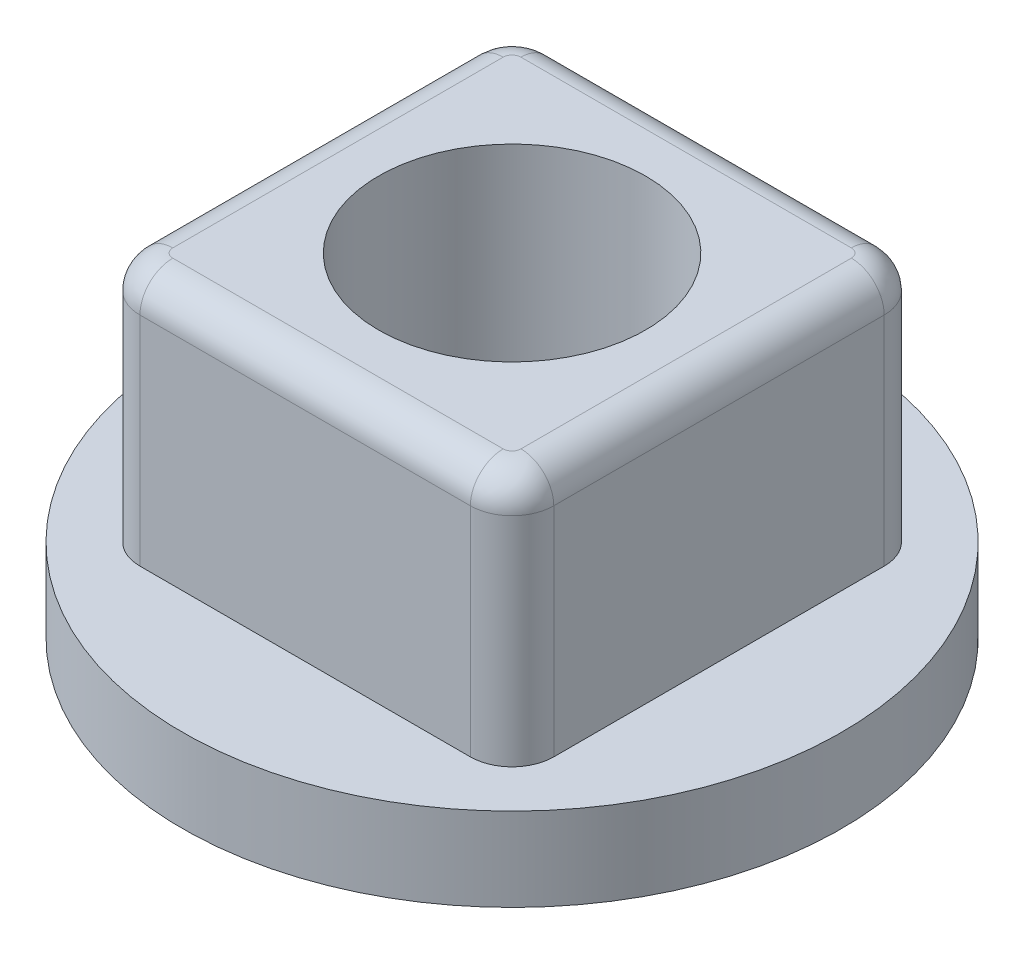
ISO-10303-21;
HEADER;
FILE_DESCRIPTION(('STEP AP214'),'2;1');
FILE_NAME('part.step','',(''),(''),'','','');
FILE_SCHEMA(('AUTOMOTIVE_DESIGN { 1 0 10303 214 1 1 1 1 }'));
ENDSEC;
DATA;
#1=APPLICATION_CONTEXT('core data for automotive mechanical design processes');
#2=APPLICATION_PROTOCOL_DEFINITION('international standard','automotive_design',2000,#1);
#3=PRODUCT_CONTEXT('',#1,'mechanical');
#4=PRODUCT('Part','Part','',(#3));
#5=PRODUCT_RELATED_PRODUCT_CATEGORY('part','',(#4));
#6=PRODUCT_DEFINITION_FORMATION('','',#4);
#7=PRODUCT_DEFINITION_CONTEXT('part definition',#1,'design');
#8=PRODUCT_DEFINITION('design','',#6,#7);
#9=PRODUCT_DEFINITION_SHAPE('','',#8);
#10=(LENGTH_UNIT() NAMED_UNIT(*) SI_UNIT(.MILLI.,.METRE.));
#11=(NAMED_UNIT(*) PLANE_ANGLE_UNIT() SI_UNIT($,.RADIAN.));
#12=(NAMED_UNIT(*) SI_UNIT($,.STERADIAN.) SOLID_ANGLE_UNIT());
#13=UNCERTAINTY_MEASURE_WITH_UNIT(LENGTH_MEASURE(1.E-05),#10,'distance_accuracy_value','');
#14=(GEOMETRIC_REPRESENTATION_CONTEXT(3) GLOBAL_UNCERTAINTY_ASSIGNED_CONTEXT((#13)) GLOBAL_UNIT_ASSIGNED_CONTEXT((#10,
#11,#12)) REPRESENTATION_CONTEXT('',''));
#15=CARTESIAN_POINT('',(0.,0.,0.));
#16=DIRECTION('',(0.,0.,1.));
#17=DIRECTION('',(1.,0.,0.));
#18=AXIS2_PLACEMENT_3D('',#15,#16,#17);
#19=CARTESIAN_POINT('',(-2.5146,5.08,2.5146));
#20=DIRECTION('',(0.,-1.,0.));
#21=DIRECTION('',(0.,0.,-1.));
#22=AXIS2_PLACEMENT_3D('',#19,#20,#21);
#23=CYLINDRICAL_SURFACE('',#22,0.635);
#24=DIRECTION('',(0.,1.,0.));
#25=VECTOR('',#24,1.);
#26=CARTESIAN_POINT('',(-3.1496,5.08,2.51459999999995));
#27=LINE('',#26,#25);
#28=CARTESIAN_POINT('',(-3.14960000000036,4.58,2.51460000000302));
#29=VERTEX_POINT('',#28);
#30=CARTESIAN_POINT('',(-3.1496,1.27,2.51459999999997));
#31=VERTEX_POINT('',#30);
#32=EDGE_CURVE('E67',#29,#31,#27,.F.);
#33=ORIENTED_EDGE('',*,*,#32,.T.);
#34=CARTESIAN_POINT('',(-2.5146,1.27,2.5146));
#35=DIRECTION('',(0.,-1.,0.));
#36=DIRECTION('',(0.,0.,-1.));
#37=AXIS2_PLACEMENT_3D('',#34,#35,#36);
#38=CIRCLE('',#37,0.635);
#39=CARTESIAN_POINT('',(-2.5146,1.27,3.1496));
#40=VERTEX_POINT('',#39);
#41=EDGE_CURVE('E19',#31,#40,#38,.F.);
#42=ORIENTED_EDGE('',*,*,#41,.T.);
#43=DIRECTION('',(0.,1.,0.));
#44=VECTOR('',#43,1.);
#45=CARTESIAN_POINT('',(-2.5146,5.08,3.1496));
#46=LINE('',#45,#44);
#47=CARTESIAN_POINT('',(-2.5146,4.58,3.14959999999967));
#48=VERTEX_POINT('',#47);
#49=EDGE_CURVE('E64',#40,#48,#46,.T.);
#50=ORIENTED_EDGE('',*,*,#49,.T.);
#51=CARTESIAN_POINT('',(-2.51460000000003,4.58000000000001,2.51459999999865));
#52=DIRECTION('',(0.,-1.,0.));
#53=DIRECTION('',(0.,0.,-1.));
#54=AXIS2_PLACEMENT_3D('',#51,#52,#53);
#55=CIRCLE('',#54,0.635000000000685);
#56=EDGE_CURVE('E230',#29,#48,#55,.F.);
#57=ORIENTED_EDGE('',*,*,#56,.F.);
#58=EDGE_LOOP('',(#33,#42,#50,#57));
#59=FACE_BOUND('',#58,.T.);
#60=ADVANCED_FACE('F16',(#59),#23,.T.);
#61=CARTESIAN_POINT('',(-2.5146,5.08,-2.5146));
#62=DIRECTION('',(0.,-1.,0.));
#63=DIRECTION('',(0.,0.,-1.));
#64=AXIS2_PLACEMENT_3D('',#61,#62,#63);
#65=CYLINDRICAL_SURFACE('',#64,0.635);
#66=DIRECTION('',(0.,1.,0.));
#67=VECTOR('',#66,1.);
#68=CARTESIAN_POINT('',(-2.51459999999995,5.08,-3.1496));
#69=LINE('',#68,#67);
#70=CARTESIAN_POINT('',(-2.51460000000237,4.58000000000076,-3.1496));
#71=VERTEX_POINT('',#70);
#72=CARTESIAN_POINT('',(-2.51459999999997,1.27,-3.1496));
#73=VERTEX_POINT('',#72);
#74=EDGE_CURVE('E186',#71,#73,#69,.F.);
#75=ORIENTED_EDGE('',*,*,#74,.T.);
#76=CARTESIAN_POINT('',(-2.5146,1.27,-2.5146));
#77=DIRECTION('',(0.,-1.,0.));
#78=DIRECTION('',(0.,0.,-1.));
#79=AXIS2_PLACEMENT_3D('',#76,#77,#78);
#80=CIRCLE('',#79,0.635);
#81=CARTESIAN_POINT('',(-3.1496,1.27,-2.5146));
#82=VERTEX_POINT('',#81);
#83=EDGE_CURVE('E69',#73,#82,#80,.F.);
#84=ORIENTED_EDGE('',*,*,#83,.T.);
#85=DIRECTION('',(0.,1.,0.));
#86=VECTOR('',#85,1.);
#87=CARTESIAN_POINT('',(-3.1496,5.08,-2.5146));
#88=LINE('',#87,#86);
#89=CARTESIAN_POINT('',(-3.14959999999983,4.58,-2.5146));
#90=VERTEX_POINT('',#89);
#91=EDGE_CURVE('E199',#82,#90,#88,.T.);
#92=ORIENTED_EDGE('',*,*,#91,.T.);
#93=CARTESIAN_POINT('',(-2.51459999999865,4.58000000000001,-2.51460000000003));
#94=DIRECTION('',(0.,-1.,0.));
#95=DIRECTION('',(1.,0.,0.));
#96=AXIS2_PLACEMENT_3D('',#93,#94,#95);
#97=CIRCLE('',#96,0.635000000000685);
#98=EDGE_CURVE('E240',#71,#90,#97,.F.);
#99=ORIENTED_EDGE('',*,*,#98,.F.);
#100=EDGE_LOOP('',(#75,#84,#92,#99));
#101=FACE_BOUND('',#100,.T.);
#102=ADVANCED_FACE('F367',(#101),#65,.T.);
#103=CARTESIAN_POINT('',(2.5146,5.08,2.5146));
#104=DIRECTION('',(0.,-1.,0.));
#105=DIRECTION('',(0.,0.,-1.));
#106=AXIS2_PLACEMENT_3D('',#103,#104,#105);
#107=CYLINDRICAL_SURFACE('',#106,0.635);
#108=DIRECTION('',(0.,1.,0.));
#109=VECTOR('',#108,1.);
#110=CARTESIAN_POINT('',(2.51459999999995,5.08,3.1496));
#111=LINE('',#110,#109);
#112=CARTESIAN_POINT('',(2.51460000000302,4.58,3.14960000000036));
#113=VERTEX_POINT('',#112);
#114=CARTESIAN_POINT('',(2.51459999999997,1.27,3.1496));
#115=VERTEX_POINT('',#114);
#116=EDGE_CURVE('E202',#113,#115,#111,.F.);
#117=ORIENTED_EDGE('',*,*,#116,.T.);
#118=CARTESIAN_POINT('',(2.5146,1.27,2.5146));
#119=DIRECTION('',(0.,-1.,0.));
#120=DIRECTION('',(0.,0.,-1.));
#121=AXIS2_PLACEMENT_3D('',#118,#119,#120);
#122=CIRCLE('',#121,0.635);
#123=CARTESIAN_POINT('',(3.1496,1.27,2.5146));
#124=VERTEX_POINT('',#123);
#125=EDGE_CURVE('E81',#115,#124,#122,.F.);
#126=ORIENTED_EDGE('',*,*,#125,.T.);
#127=DIRECTION('',(0.,1.,0.));
#128=VECTOR('',#127,1.);
#129=CARTESIAN_POINT('',(3.1496,5.08,2.5146));
#130=LINE('',#129,#128);
#131=CARTESIAN_POINT('',(3.14959999999983,4.58,2.51460000000015));
#132=VERTEX_POINT('',#131);
#133=EDGE_CURVE('E183',#124,#132,#130,.T.);
#134=ORIENTED_EDGE('',*,*,#133,.T.);
#135=CARTESIAN_POINT('',(2.51459999999865,4.58000000000001,2.51460000000003));
#136=DIRECTION('',(0.,-1.,0.));
#137=DIRECTION('',(1.,0.,0.));
#138=AXIS2_PLACEMENT_3D('',#135,#136,#137);
#139=CIRCLE('',#138,0.635000000000685);
#140=EDGE_CURVE('E299',#113,#132,#139,.F.);
#141=ORIENTED_EDGE('',*,*,#140,.F.);
#142=EDGE_LOOP('',(#117,#126,#134,#141));
#143=FACE_BOUND('',#142,.T.);
#144=ADVANCED_FACE('F398',(#143),#107,.T.);
#145=CARTESIAN_POINT('',(2.5146,5.08,-2.5146));
#146=DIRECTION('',(0.,-1.,0.));
#147=DIRECTION('',(0.,0.,-1.));
#148=AXIS2_PLACEMENT_3D('',#145,#146,#147);
#149=CYLINDRICAL_SURFACE('',#148,0.635);
#150=DIRECTION('',(0.,1.,0.));
#151=VECTOR('',#150,1.);
#152=CARTESIAN_POINT('',(3.1496,5.08,-2.51459999999997));
#153=LINE('',#152,#151);
#154=CARTESIAN_POINT('',(3.14960000000036,4.58,-2.51460000000303));
#155=VERTEX_POINT('',#154);
#156=CARTESIAN_POINT('',(3.1496,1.27,-2.51459999999999));
#157=VERTEX_POINT('',#156);
#158=EDGE_CURVE('E170',#155,#157,#153,.F.);
#159=ORIENTED_EDGE('',*,*,#158,.T.);
#160=CARTESIAN_POINT('',(2.5146,1.27,-2.5146));
#161=DIRECTION('',(0.,-1.,0.));
#162=DIRECTION('',(0.,0.,-1.));
#163=AXIS2_PLACEMENT_3D('',#160,#161,#162);
#164=CIRCLE('',#163,0.635);
#165=CARTESIAN_POINT('',(2.5146,1.27,-3.1496));
#166=VERTEX_POINT('',#165);
#167=EDGE_CURVE('E34',#157,#166,#164,.F.);
#168=ORIENTED_EDGE('',*,*,#167,.T.);
#169=DIRECTION('',(0.,1.,0.));
#170=VECTOR('',#169,1.);
#171=CARTESIAN_POINT('',(2.5146,5.08,-3.1496));
#172=LINE('',#171,#170);
#173=CARTESIAN_POINT('',(2.51460000000001,4.58,-3.14959999999983));
#174=VERTEX_POINT('',#173);
#175=EDGE_CURVE('E189',#166,#174,#172,.T.);
#176=ORIENTED_EDGE('',*,*,#175,.T.);
#177=CARTESIAN_POINT('',(2.51460000000003,4.58000000000001,-2.51459999999865));
#178=DIRECTION('',(0.,-1.,0.));
#179=DIRECTION('',(0.,0.,-1.));
#180=AXIS2_PLACEMENT_3D('',#177,#178,#179);
#181=CIRCLE('',#180,0.635000000000685);
#182=EDGE_CURVE('E269',#155,#174,#181,.F.);
#183=ORIENTED_EDGE('',*,*,#182,.F.);
#184=EDGE_LOOP('',(#159,#168,#176,#183));
#185=FACE_BOUND('',#184,.T.);
#186=ADVANCED_FACE('F411',(#185),#149,.T.);
#187=CARTESIAN_POINT('',(2.538898108304,4.58,2.6496));
#188=DIRECTION('',(-1.,0.,0.));
#189=DIRECTION('',(0.,0.,1.));
#190=AXIS2_PLACEMENT_3D('',#187,#188,#189);
#191=CYLINDRICAL_SURFACE('',#190,0.5);
#192=CARTESIAN_POINT('',(2.51460000000023,4.58000000000151,2.64960000000213));
#193=DIRECTION('',(-1.,0.,1.17253486400112E-11));
#194=DIRECTION('',(1.17253486400112E-11,0.,1.));
#195=AXIS2_PLACEMENT_3D('',#192,#193,#194);
#196=CIRCLE('',#195,0.499999999998586);
#197=CARTESIAN_POINT('',(2.51460000000024,5.08000000000005,2.64959999798593));
#198=VERTEX_POINT('',#197);
#199=EDGE_CURVE('E169',#198,#113,#196,.F.);
#200=ORIENTED_EDGE('',*,*,#199,.F.);
#201=DIRECTION('',(1.,0.,0.));
#202=VECTOR('',#201,1.);
#203=CARTESIAN_POINT('',(-3.1496,5.08,2.6496));
#204=LINE('',#203,#202);
#205=CARTESIAN_POINT('',(-2.51460000000002,5.08000000000005,2.64960000000019));
#206=VERTEX_POINT('',#205);
#207=EDGE_CURVE('E156',#206,#198,#204,.T.);
#208=ORIENTED_EDGE('',*,*,#207,.F.);
#209=CARTESIAN_POINT('',(-2.51460000000002,4.58000000000152,2.64960000000074));
#210=DIRECTION('',(-1.,0.,0.));
#211=DIRECTION('',(0.,0.,1.));
#212=AXIS2_PLACEMENT_3D('',#209,#210,#211);
#213=CIRCLE('',#212,0.499999999998586);
#214=EDGE_CURVE('E78',#48,#206,#213,.T.);
#215=ORIENTED_EDGE('',*,*,#214,.F.);
#216=DIRECTION('',(-1.,0.,0.));
#217=VECTOR('',#216,1.);
#218=CARTESIAN_POINT('',(-3.1496,4.58,3.1496));
#219=LINE('',#218,#217);
#220=EDGE_CURVE('E76',#48,#113,#219,.F.);
#221=ORIENTED_EDGE('',*,*,#220,.T.);
#222=EDGE_LOOP('',(#200,#208,#215,#221));
#223=FACE_BOUND('',#222,.T.);
#224=ADVANCED_FACE('F167',(#223),#191,.T.);
#225=CARTESIAN_POINT('',(2.64960000000074,4.58000000000151,2.51460000000003));
#226=DIRECTION('',(0.,0.,1.));
#227=DIRECTION('',(1.,0.,0.));
#228=AXIS2_PLACEMENT_3D('',#225,#226,#227);
#229=CIRCLE('',#228,0.499999999998586);
#230=TRIMMED_CURVE('',#229,(PARAMETER_VALUE(-1.84418935826752)),
(PARAMETER_VALUE(1.84418935826752)),.T.,.PARAMETER.);
#231=CARTESIAN_POINT('',(2.51459999999865,4.58000000000152,2.51460000000003));
#232=DIRECTION('',(0.,-1.,0.));
#233=AXIS1_PLACEMENT('',#231,#232);
#234=SURFACE_OF_REVOLUTION('',#230,#233);
#235=CARTESIAN_POINT('',(2.6496,4.58,2.51460000000056));
#236=DIRECTION('',(0.,0.,1.));
#237=DIRECTION('',(1.,0.,0.));
#238=AXIS2_PLACEMENT_3D('',#235,#236,#237);
#239=CIRCLE('',#238,0.5);
#240=CARTESIAN_POINT('',(2.64959999764931,5.08000000000002,2.51460000000043));
#241=VERTEX_POINT('',#240);
#242=EDGE_CURVE('E294',#241,#132,#239,.F.);
#243=ORIENTED_EDGE('',*,*,#242,.F.);
#244=CARTESIAN_POINT('',(2.51459999999865,5.0800000000001,2.51460000000004));
#245=DIRECTION('',(0.,-1.,0.));
#246=DIRECTION('',(1.,0.,0.));
#247=AXIS2_PLACEMENT_3D('',#244,#245,#246);
#248=CIRCLE('',#247,0.134999998658406);
#249=EDGE_CURVE('E99',#198,#241,#248,.F.);
#250=ORIENTED_EDGE('',*,*,#249,.F.);
#251=ORIENTED_EDGE('',*,*,#199,.T.);
#252=ORIENTED_EDGE('',*,*,#140,.T.);
#253=EDGE_LOOP('',(#243,#250,#251,#252));
#254=FACE_BOUND('',#253,.T.);
#255=ADVANCED_FACE('F305',(#254),#234,.F.);
#256=CARTESIAN_POINT('',(2.6496,4.58,-2.538898108304));
#257=DIRECTION('',(0.,0.,1.));
#258=DIRECTION('',(1.,0.,0.));
#259=AXIS2_PLACEMENT_3D('',#256,#257,#258);
#260=CYLINDRICAL_SURFACE('',#259,0.5);
#261=CARTESIAN_POINT('',(2.64960000000213,4.58000000000151,-2.51460000000023));
#262=DIRECTION('',(1.17253486400112E-11,0.,1.));
#263=DIRECTION('',(1.,0.,-1.17253486400112E-11));
#264=AXIS2_PLACEMENT_3D('',#261,#262,#263);
#265=CIRCLE('',#264,0.499999999998586);
#266=CARTESIAN_POINT('',(2.64959999865759,5.08000000000005,-2.51460000000024));
#267=VERTEX_POINT('',#266);
#268=EDGE_CURVE('E286',#267,#155,#265,.F.);
#269=ORIENTED_EDGE('',*,*,#268,.F.);
#270=DIRECTION('',(0.,0.,1.));
#271=VECTOR('',#270,1.);
#272=CARTESIAN_POINT('',(2.64959999731337,5.08,3.1496));
#273=LINE('',#272,#271);
#274=EDGE_CURVE('E172',#241,#267,#273,.F.);
#275=ORIENTED_EDGE('',*,*,#274,.F.);
#276=ORIENTED_EDGE('',*,*,#242,.T.);
#277=DIRECTION('',(0.,0.,1.));
#278=VECTOR('',#277,1.);
#279=CARTESIAN_POINT('',(3.1496,4.58,-3.1496));
#280=LINE('',#279,#278);
#281=EDGE_CURVE('E173',#132,#155,#280,.F.);
#282=ORIENTED_EDGE('',*,*,#281,.T.);
#283=EDGE_LOOP('',(#269,#275,#276,#282));
#284=FACE_BOUND('',#283,.T.);
#285=ADVANCED_FACE('F280',(#284),#260,.T.);
#286=CARTESIAN_POINT('',(2.51460000000003,4.58000000000151,-2.64960000000074));
#287=DIRECTION('',(1.,0.,0.));
#288=DIRECTION('',(0.,0.,-1.));
#289=AXIS2_PLACEMENT_3D('',#286,#287,#288);
#290=CIRCLE('',#289,0.499999999998586);
#291=TRIMMED_CURVE('',#290,(PARAMETER_VALUE(-1.84418935826752)),
(PARAMETER_VALUE(1.84418935826752)),.T.,.PARAMETER.);
#292=CARTESIAN_POINT('',(2.51460000000003,4.58000000000152,-2.51459999999865));
#293=DIRECTION('',(0.,-1.,0.));
#294=AXIS1_PLACEMENT('',#292,#293);
#295=SURFACE_OF_REVOLUTION('',#291,#294);
#296=CARTESIAN_POINT('',(2.5146,4.58,-2.6496));
#297=DIRECTION('',(1.,0.,0.));
#298=DIRECTION('',(0.,0.,-1.));
#299=AXIS2_PLACEMENT_3D('',#296,#297,#298);
#300=CIRCLE('',#299,0.5);
#301=CARTESIAN_POINT('',(2.51460000000001,5.08000000000002,-2.64959999932845));
#302=VERTEX_POINT('',#301);
#303=EDGE_CURVE('E264',#302,#174,#300,.F.);
#304=ORIENTED_EDGE('',*,*,#303,.F.);
#305=CARTESIAN_POINT('',(2.51460000000004,5.0800000000001,-2.51459999999865));
#306=DIRECTION('',(0.,-1.,0.));
#307=DIRECTION('',(0.,0.,-1.));
#308=AXIS2_PLACEMENT_3D('',#305,#306,#307);
#309=CIRCLE('',#308,0.135000000001723);
#310=EDGE_CURVE('E418',#267,#302,#309,.F.);
#311=ORIENTED_EDGE('',*,*,#310,.F.);
#312=ORIENTED_EDGE('',*,*,#268,.T.);
#313=ORIENTED_EDGE('',*,*,#182,.T.);
#314=EDGE_LOOP('',(#304,#311,#312,#313));
#315=FACE_BOUND('',#314,.T.);
#316=ADVANCED_FACE('F276',(#315),#295,.F.);
#317=CARTESIAN_POINT('',(-2.538898108304,4.58,-2.6496));
#318=DIRECTION('',(1.,0.,0.));
#319=DIRECTION('',(0.,0.,-1.));
#320=AXIS2_PLACEMENT_3D('',#317,#318,#319);
#321=CYLINDRICAL_SURFACE('',#320,0.5);
#322=CARTESIAN_POINT('',(-2.51460000000023,4.58000000000152,-2.64960000000213));
#323=DIRECTION('',(1.,0.,-1.17259151939009E-11));
#324=DIRECTION('',(-1.17259151939009E-11,0.,-1.));
#325=AXIS2_PLACEMENT_3D('',#322,#323,#324);
#326=CIRCLE('',#325,0.499999999998586);
#327=CARTESIAN_POINT('',(-2.51460000000024,5.08000000000005,-2.64959999865759));
#328=VERTEX_POINT('',#327);
#329=EDGE_CURVE('E256',#328,#71,#326,.F.);
#330=ORIENTED_EDGE('',*,*,#329,.F.);
#331=DIRECTION('',(1.,0.,0.));
#332=VECTOR('',#331,1.);
#333=CARTESIAN_POINT('',(-3.1496,5.08,-2.6496));
#334=LINE('',#333,#332);
#335=EDGE_CURVE('E417',#302,#328,#334,.F.);
#336=ORIENTED_EDGE('',*,*,#335,.F.);
#337=ORIENTED_EDGE('',*,*,#303,.T.);
#338=DIRECTION('',(1.,0.,0.));
#339=VECTOR('',#338,1.);
#340=CARTESIAN_POINT('',(-3.1496,4.58,-3.1496));
#341=LINE('',#340,#339);
#342=EDGE_CURVE('E192',#174,#71,#341,.F.);
#343=ORIENTED_EDGE('',*,*,#342,.T.);
#344=EDGE_LOOP('',(#330,#336,#337,#343));
#345=FACE_BOUND('',#344,.T.);
#346=ADVANCED_FACE('F250',(#345),#321,.T.);
#347=CARTESIAN_POINT('',(-2.37959999999655,4.58000000000152,-2.51460000000003));
#348=DIRECTION('',(0.,0.,1.));
#349=DIRECTION('',(1.,0.,0.));
#350=AXIS2_PLACEMENT_3D('',#347,#348,#349);
#351=CIRCLE('',#350,0.499999999998586);
#352=TRIMMED_CURVE('',#351,(PARAMETER_VALUE(-1.84418935826752)),
(PARAMETER_VALUE(1.84418935826752)),.T.,.PARAMETER.);
#353=CARTESIAN_POINT('',(-2.51459999999865,4.58000000000152,-2.51460000000003));
#354=DIRECTION('',(0.,-1.,0.));
#355=AXIS1_PLACEMENT('',#353,#354);
#356=SURFACE_OF_REVOLUTION('',#352,#355);
#357=CARTESIAN_POINT('',(-2.6496,4.58,-2.5146));
#358=DIRECTION('',(0.,0.,-1.));
#359=DIRECTION('',(-1.,0.,0.));
#360=AXIS2_PLACEMENT_3D('',#357,#358,#359);
#361=CIRCLE('',#360,0.5);
#362=CARTESIAN_POINT('',(-2.64959999932845,5.08000000000002,-2.51460000000001));
#363=VERTEX_POINT('',#362);
#364=EDGE_CURVE('E235',#363,#90,#361,.F.);
#365=ORIENTED_EDGE('',*,*,#364,.F.);
#366=CARTESIAN_POINT('',(-2.51459999999865,5.0800000000001,-2.51460000000004));
#367=DIRECTION('',(0.,-1.,0.));
#368=DIRECTION('',(-1.,0.,0.));
#369=AXIS2_PLACEMENT_3D('',#366,#367,#368);
#370=CIRCLE('',#369,0.135000000001722);
#371=EDGE_CURVE('E142',#328,#363,#370,.F.);
#372=ORIENTED_EDGE('',*,*,#371,.F.);
#373=ORIENTED_EDGE('',*,*,#329,.T.);
#374=ORIENTED_EDGE('',*,*,#98,.T.);
#375=EDGE_LOOP('',(#365,#372,#373,#374));
#376=FACE_BOUND('',#375,.T.);
#377=ADVANCED_FACE('F246',(#376),#356,.F.);
#378=CARTESIAN_POINT('',(-2.6496,4.58,2.538898108304));
#379=DIRECTION('',(0.,0.,-1.));
#380=DIRECTION('',(-1.,0.,0.));
#381=AXIS2_PLACEMENT_3D('',#378,#379,#380);
#382=CYLINDRICAL_SURFACE('',#381,0.5);
#383=CARTESIAN_POINT('',(-2.64960000000213,4.58000000000152,2.51460000000023));
#384=DIRECTION('',(-1.17259151939009E-11,0.,-1.));
#385=DIRECTION('',(-1.,0.,1.17259151939009E-11));
#386=AXIS2_PLACEMENT_3D('',#383,#384,#385);
#387=CIRCLE('',#386,0.499999999998586);
#388=CARTESIAN_POINT('',(-2.64959999865759,5.08000000000005,2.51460000000024));
#389=VERTEX_POINT('',#388);
#390=EDGE_CURVE('E233',#389,#29,#387,.F.);
#391=ORIENTED_EDGE('',*,*,#390,.F.);
#392=DIRECTION('',(0.,0.,1.));
#393=VECTOR('',#392,1.);
#394=CARTESIAN_POINT('',(-2.6496,5.08,3.1496));
#395=LINE('',#394,#393);
#396=EDGE_CURVE('E89',#363,#389,#395,.T.);
#397=ORIENTED_EDGE('',*,*,#396,.F.);
#398=ORIENTED_EDGE('',*,*,#364,.T.);
#399=DIRECTION('',(0.,0.,-1.));
#400=VECTOR('',#399,1.);
#401=CARTESIAN_POINT('',(-3.1496,4.58,-3.1496));
#402=LINE('',#401,#400);
#403=EDGE_CURVE('E196',#90,#29,#402,.F.);
#404=ORIENTED_EDGE('',*,*,#403,.T.);
#405=EDGE_LOOP('',(#391,#397,#398,#404));
#406=FACE_BOUND('',#405,.T.);
#407=ADVANCED_FACE('F218',(#406),#382,.T.);
#408=CARTESIAN_POINT('',(-2.51460000000003,4.58000000000152,2.37959999999655));
#409=DIRECTION('',(1.,0.,0.));
#410=DIRECTION('',(0.,0.,-1.));
#411=AXIS2_PLACEMENT_3D('',#408,#409,#410);
#412=CIRCLE('',#411,0.499999999998586);
#413=TRIMMED_CURVE('',#412,(PARAMETER_VALUE(-1.84418935826752)),
(PARAMETER_VALUE(1.84418935826752)),.T.,.PARAMETER.);
#414=CARTESIAN_POINT('',(-2.51460000000003,4.58000000000152,2.51459999999865));
#415=DIRECTION('',(0.,-1.,0.));
#416=AXIS1_PLACEMENT('',#414,#415);
#417=SURFACE_OF_REVOLUTION('',#413,#416);
#418=ORIENTED_EDGE('',*,*,#214,.T.);
#419=CARTESIAN_POINT('',(-2.51460000000004,5.0800000000001,2.51459999999865));
#420=DIRECTION('',(0.,-1.,0.));
#421=DIRECTION('',(0.,0.,1.));
#422=AXIS2_PLACEMENT_3D('',#419,#420,#421);
#423=CIRCLE('',#422,0.135000000001722);
#424=EDGE_CURVE('E84',#389,#206,#423,.F.);
#425=ORIENTED_EDGE('',*,*,#424,.F.);
#426=ORIENTED_EDGE('',*,*,#390,.T.);
#427=ORIENTED_EDGE('',*,*,#56,.T.);
#428=EDGE_LOOP('',(#418,#425,#426,#427));
#429=FACE_BOUND('',#428,.T.);
#430=ADVANCED_FACE('F213',(#429),#417,.F.);
#431=CARTESIAN_POINT('',(-3.1496,5.08,3.1496));
#432=DIRECTION('',(0.,0.,-1.));
#433=DIRECTION('',(-1.,0.,0.));
#434=AXIS2_PLACEMENT_3D('',#431,#432,#433);
#435=PLANE('',#434);
#436=ORIENTED_EDGE('',*,*,#116,.F.);
#437=ORIENTED_EDGE('',*,*,#220,.F.);
#438=ORIENTED_EDGE('',*,*,#49,.F.);
#439=DIRECTION('',(1.,0.,0.));
#440=VECTOR('',#439,1.);
#441=CARTESIAN_POINT('',(0.,1.27,3.1496));
#442=LINE('',#441,#440);
#443=EDGE_CURVE('E74',#115,#40,#442,.F.);
#444=ORIENTED_EDGE('',*,*,#443,.F.);
#445=EDGE_LOOP('',(#436,#437,#438,#444));
#446=FACE_BOUND('',#445,.T.);
#447=ADVANCED_FACE('F73',(#446),#435,.F.);
#448=CARTESIAN_POINT('',(-3.1496,5.08,-3.1496));
#449=DIRECTION('',(1.,0.,0.));
#450=DIRECTION('',(0.,0.,-1.));
#451=AXIS2_PLACEMENT_3D('',#448,#449,#450);
#452=PLANE('',#451);
#453=ORIENTED_EDGE('',*,*,#32,.F.);
#454=ORIENTED_EDGE('',*,*,#403,.F.);
#455=ORIENTED_EDGE('',*,*,#91,.F.);
#456=DIRECTION('',(0.,0.,1.));
#457=VECTOR('',#456,1.);
#458=CARTESIAN_POINT('',(-3.1496,1.27,0.));
#459=LINE('',#458,#457);
#460=EDGE_CURVE('E83',#31,#82,#459,.F.);
#461=ORIENTED_EDGE('',*,*,#460,.F.);
#462=EDGE_LOOP('',(#453,#454,#455,#461));
#463=FACE_BOUND('',#462,.T.);
#464=ADVANCED_FACE('F374',(#463),#452,.F.);
#465=CARTESIAN_POINT('',(-3.1496,5.08,-3.1496));
#466=DIRECTION('',(0.,0.,1.));
#467=DIRECTION('',(1.,0.,0.));
#468=AXIS2_PLACEMENT_3D('',#465,#466,#467);
#469=PLANE('',#468);
#470=ORIENTED_EDGE('',*,*,#74,.F.);
#471=ORIENTED_EDGE('',*,*,#342,.F.);
#472=ORIENTED_EDGE('',*,*,#175,.F.);
#473=DIRECTION('',(1.,0.,0.));
#474=VECTOR('',#473,1.);
#475=CARTESIAN_POINT('',(0.,1.27,-3.1496));
#476=LINE('',#475,#474);
#477=EDGE_CURVE('E86',#73,#166,#476,.T.);
#478=ORIENTED_EDGE('',*,*,#477,.F.);
#479=EDGE_LOOP('',(#470,#471,#472,#478));
#480=FACE_BOUND('',#479,.T.);
#481=ADVANCED_FACE('F407',(#480),#469,.F.);
#482=CARTESIAN_POINT('',(3.1496,5.08,-3.1496));
#483=DIRECTION('',(-1.,0.,0.));
#484=DIRECTION('',(0.,0.,1.));
#485=AXIS2_PLACEMENT_3D('',#482,#483,#484);
#486=PLANE('',#485);
#487=ORIENTED_EDGE('',*,*,#158,.F.);
#488=ORIENTED_EDGE('',*,*,#281,.F.);
#489=ORIENTED_EDGE('',*,*,#133,.F.);
#490=DIRECTION('',(0.,0.,1.));
#491=VECTOR('',#490,1.);
#492=CARTESIAN_POINT('',(3.1496,1.27,0.));
#493=LINE('',#492,#491);
#494=EDGE_CURVE('E361',#157,#124,#493,.T.);
#495=ORIENTED_EDGE('',*,*,#494,.F.);
#496=EDGE_LOOP('',(#487,#488,#489,#495));
#497=FACE_BOUND('',#496,.T.);
#498=ADVANCED_FACE('F117',(#497),#486,.F.);
#499=CARTESIAN_POINT('',(-3.1496,5.08,3.1496));
#500=DIRECTION('',(0.,1.,0.));
#501=DIRECTION('',(0.,0.,1.));
#502=AXIS2_PLACEMENT_3D('',#499,#500,#501);
#503=PLANE('',#502);
#504=ORIENTED_EDGE('',*,*,#396,.T.);
#505=ORIENTED_EDGE('',*,*,#424,.T.);
#506=ORIENTED_EDGE('',*,*,#207,.T.);
#507=ORIENTED_EDGE('',*,*,#249,.T.);
#508=ORIENTED_EDGE('',*,*,#274,.T.);
#509=ORIENTED_EDGE('',*,*,#310,.T.);
#510=ORIENTED_EDGE('',*,*,#335,.T.);
#511=ORIENTED_EDGE('',*,*,#371,.T.);
#512=EDGE_LOOP('',(#504,#505,#506,#507,#508,#509,#510,#511));
#513=FACE_BOUND('',#512,.T.);
#514=CARTESIAN_POINT('',(0.,5.08,0.));
#515=DIRECTION('',(0.,-1.,0.));
#516=DIRECTION('',(0.,0.,-1.));
#517=AXIS2_PLACEMENT_3D('',#514,#515,#516);
#518=CIRCLE('',#517,2.032);
#519=CARTESIAN_POINT('',(0.,5.08,-2.032));
#520=VERTEX_POINT('',#519);
#521=EDGE_CURVE('E358',#520,#520,#518,.T.);
#522=ORIENTED_EDGE('',*,*,#521,.T.);
#523=EDGE_LOOP('',(#522));
#524=FACE_BOUND('',#523,.T.);
#525=ADVANCED_FACE('F107',(#513,#524),#503,.T.);
#526=CARTESIAN_POINT('',(0.,1.27,0.));
#527=DIRECTION('',(0.,1.,0.));
#528=DIRECTION('',(0.,0.,1.));
#529=AXIS2_PLACEMENT_3D('',#526,#527,#528);
#530=PLANE('',#529);
#531=CARTESIAN_POINT('',(0.,1.27,0.));
#532=DIRECTION('',(0.,-1.,0.));
#533=DIRECTION('',(0.,0.,-1.));
#534=AXIS2_PLACEMENT_3D('',#531,#532,#533);
#535=CIRCLE('',#534,5.0165);
#536=CARTESIAN_POINT('',(0.,1.27,-5.0165));
#537=VERTEX_POINT('',#536);
#538=EDGE_CURVE('E355',#537,#537,#535,.T.);
#539=ORIENTED_EDGE('',*,*,#538,.F.);
#540=EDGE_LOOP('',(#539));
#541=FACE_BOUND('',#540,.T.);
#542=ORIENTED_EDGE('',*,*,#167,.F.);
#543=ORIENTED_EDGE('',*,*,#494,.T.);
#544=ORIENTED_EDGE('',*,*,#125,.F.);
#545=ORIENTED_EDGE('',*,*,#443,.T.);
#546=ORIENTED_EDGE('',*,*,#41,.F.);
#547=ORIENTED_EDGE('',*,*,#460,.T.);
#548=ORIENTED_EDGE('',*,*,#83,.F.);
#549=ORIENTED_EDGE('',*,*,#477,.T.);
#550=EDGE_LOOP('',(#542,#543,#544,#545,#546,#547,#548,#549));
#551=FACE_BOUND('',#550,.T.);
#552=ADVANCED_FACE('F80',(#541,#551),#530,.T.);
#553=CARTESIAN_POINT('',(0.,0.,0.));
#554=DIRECTION('',(0.,-1.,0.));
#555=DIRECTION('',(0.,0.,-1.));
#556=AXIS2_PLACEMENT_3D('',#553,#554,#555);
#557=CYLINDRICAL_SURFACE('',#556,2.032);
#558=ORIENTED_EDGE('',*,*,#521,.F.);
#559=EDGE_LOOP('',(#558));
#560=FACE_BOUND('',#559,.T.);
#561=CARTESIAN_POINT('',(0.,0.,0.));
#562=DIRECTION('',(0.,-1.,0.));
#563=DIRECTION('',(0.,0.,-1.));
#564=AXIS2_PLACEMENT_3D('',#561,#562,#563);
#565=CIRCLE('',#564,2.032);
#566=CARTESIAN_POINT('',(0.,0.,-2.032));
#567=VERTEX_POINT('',#566);
#568=EDGE_CURVE('E25',#567,#567,#565,.T.);
#569=ORIENTED_EDGE('',*,*,#568,.T.);
#570=EDGE_LOOP('',(#569));
#571=FACE_BOUND('',#570,.T.);
#572=ADVANCED_FACE('F438',(#560,#571),#557,.F.);
#573=CARTESIAN_POINT('',(0.,1.27,0.));
#574=DIRECTION('',(0.,-1.,0.));
#575=DIRECTION('',(0.,0.,-1.));
#576=AXIS2_PLACEMENT_3D('',#573,#574,#575);
#577=CYLINDRICAL_SURFACE('',#576,5.0165);
#578=ORIENTED_EDGE('',*,*,#538,.T.);
#579=EDGE_LOOP('',(#578));
#580=FACE_BOUND('',#579,.T.);
#581=CARTESIAN_POINT('',(0.,0.,0.));
#582=DIRECTION('',(0.,-1.,0.));
#583=DIRECTION('',(0.,0.,-1.));
#584=AXIS2_PLACEMENT_3D('',#581,#582,#583);
#585=CIRCLE('',#584,5.0165);
#586=CARTESIAN_POINT('',(0.,0.,-5.0165));
#587=VERTEX_POINT('',#586);
#588=EDGE_CURVE('E11',#587,#587,#585,.F.);
#589=ORIENTED_EDGE('',*,*,#588,.T.);
#590=EDGE_LOOP('',(#589));
#591=FACE_BOUND('',#590,.T.);
#592=ADVANCED_FACE('F432',(#580,#591),#577,.T.);
#593=CARTESIAN_POINT('',(0.,0.,0.));
#594=DIRECTION('',(0.,1.,0.));
#595=DIRECTION('',(0.,0.,1.));
#596=AXIS2_PLACEMENT_3D('',#593,#594,#595);
#597=PLANE('',#596);
#598=ORIENTED_EDGE('',*,*,#588,.F.);
#599=EDGE_LOOP('',(#598));
#600=FACE_BOUND('',#599,.T.);
#601=ORIENTED_EDGE('',*,*,#568,.F.);
#602=EDGE_LOOP('',(#601));
#603=FACE_BOUND('',#602,.T.);
#604=ADVANCED_FACE('F430',(#600,#603),#597,.F.);
#605=CLOSED_SHELL('',(#60,#102,#144,#186,#224,#255,#285,#316,#346,#377,#407,#430,#447,#464,#481,
#498,#525,#552,#572,#592,#604));
#606=MANIFOLD_SOLID_BREP('B1',#605);
#607=ADVANCED_BREP_SHAPE_REPRESENTATION('',(#18,#606),#14);
#608=SHAPE_DEFINITION_REPRESENTATION(#9,#607);
ENDSEC;
END-ISO-10303-21;
